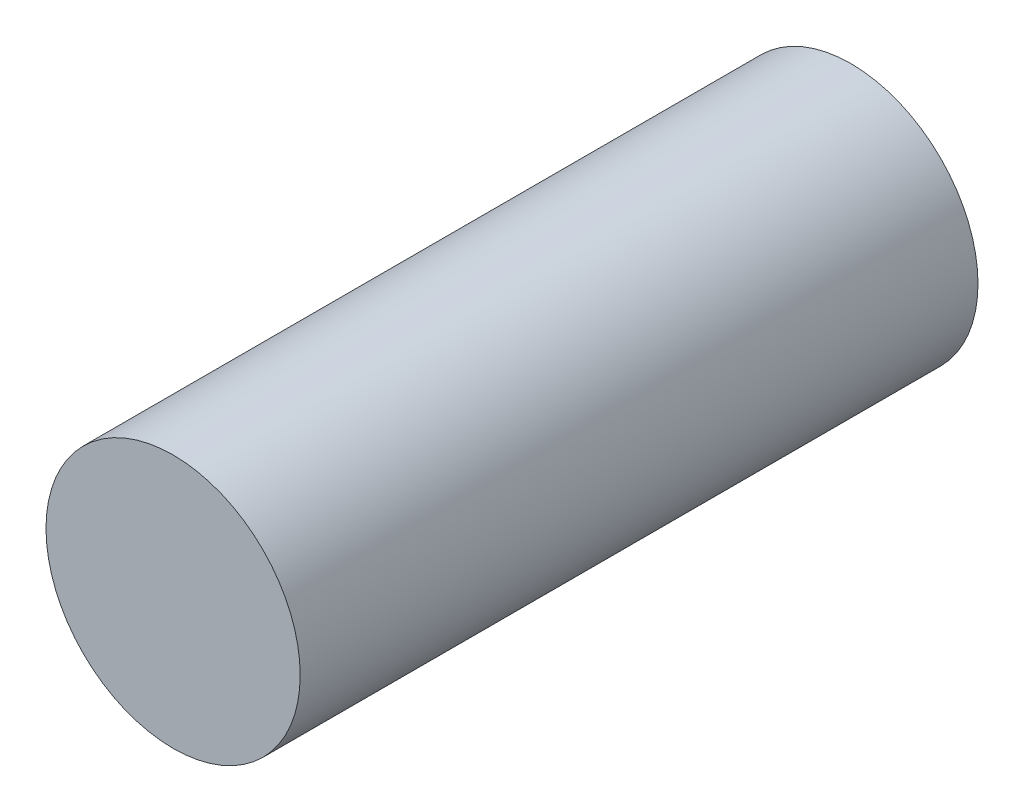
ISO-10303-21;
HEADER;
FILE_DESCRIPTION(('STEP AP214'),'2;1');
FILE_NAME('part.step','',(''),(''),'','','');
FILE_SCHEMA(('AUTOMOTIVE_DESIGN { 1 0 10303 214 1 1 1 1 }'));
ENDSEC;
DATA;
#1=APPLICATION_CONTEXT('core data for automotive mechanical design processes');
#2=APPLICATION_PROTOCOL_DEFINITION('international standard','automotive_design',2000,#1);
#3=PRODUCT_CONTEXT('',#1,'mechanical');
#4=PRODUCT('Part','Part','',(#3));
#5=PRODUCT_RELATED_PRODUCT_CATEGORY('part','',(#4));
#6=PRODUCT_DEFINITION_FORMATION('','',#4);
#7=PRODUCT_DEFINITION_CONTEXT('part definition',#1,'design');
#8=PRODUCT_DEFINITION('design','',#6,#7);
#9=PRODUCT_DEFINITION_SHAPE('','',#8);
#10=(LENGTH_UNIT() NAMED_UNIT(*) SI_UNIT(.MILLI.,.METRE.));
#11=(NAMED_UNIT(*) PLANE_ANGLE_UNIT() SI_UNIT($,.RADIAN.));
#12=(NAMED_UNIT(*) SI_UNIT($,.STERADIAN.) SOLID_ANGLE_UNIT());
#13=UNCERTAINTY_MEASURE_WITH_UNIT(LENGTH_MEASURE(1.E-05),#10,'distance_accuracy_value','');
#14=(GEOMETRIC_REPRESENTATION_CONTEXT(3) GLOBAL_UNCERTAINTY_ASSIGNED_CONTEXT((#13)) GLOBAL_UNIT_ASSIGNED_CONTEXT((#10,
#11,#12)) REPRESENTATION_CONTEXT('',''));
#15=CARTESIAN_POINT('',(0.,0.,0.));
#16=DIRECTION('',(0.,0.,1.));
#17=DIRECTION('',(1.,0.,0.));
#18=AXIS2_PLACEMENT_3D('',#15,#16,#17);
#19=CARTESIAN_POINT('',(-163.126236957769,-95.5245066159686,-10.));
#20=DIRECTION('',(0.,0.,1.));
#21=DIRECTION('',(1.,0.,0.));
#22=AXIS2_PLACEMENT_3D('',#19,#20,#21);
#23=CYLINDRICAL_SURFACE('',#22,3.75000000000001);
#24=CARTESIAN_POINT('',(-163.126236957769,-95.5245066159686,-10.));
#25=DIRECTION('',(0.,0.,1.));
#26=DIRECTION('',(1.,0.,0.));
#27=AXIS2_PLACEMENT_3D('',#24,#25,#26);
#28=CIRCLE('',#27,3.75000000000001);
#29=CARTESIAN_POINT('',(-159.376236957769,-95.5245066159686,-10.));
#30=VERTEX_POINT('',#29);
#31=EDGE_CURVE('E41',#30,#30,#28,.T.);
#32=ORIENTED_EDGE('',*,*,#31,.T.);
#33=EDGE_LOOP('',(#32));
#34=FACE_BOUND('',#33,.T.);
#35=CARTESIAN_POINT('',(-163.126236957769,-95.5245066159686,10.));
#36=DIRECTION('',(0.,0.,1.));
#37=DIRECTION('',(1.,0.,0.));
#38=AXIS2_PLACEMENT_3D('',#35,#36,#37);
#39=CIRCLE('',#38,3.75000000000001);
#40=CARTESIAN_POINT('',(-159.376236957769,-95.5245066159686,10.));
#41=VERTEX_POINT('',#40);
#42=EDGE_CURVE('E10',#41,#41,#39,.T.);
#43=ORIENTED_EDGE('',*,*,#42,.F.);
#44=EDGE_LOOP('',(#43));
#45=FACE_BOUND('',#44,.T.);
#46=ADVANCED_FACE('F34',(#34,#45),#23,.T.);
#47=CARTESIAN_POINT('',(-163.126236957769,-95.5245066159686,-10.));
#48=DIRECTION('',(0.,0.,1.));
#49=DIRECTION('',(1.,0.,0.));
#50=AXIS2_PLACEMENT_3D('',#47,#48,#49);
#51=PLANE('',#50);
#52=ORIENTED_EDGE('',*,*,#31,.F.);
#53=EDGE_LOOP('',(#52));
#54=FACE_BOUND('',#53,.T.);
#55=ADVANCED_FACE('F49',(#54),#51,.F.);
#56=CARTESIAN_POINT('',(-163.126236957769,-95.5245066159686,10.));
#57=DIRECTION('',(0.,0.,1.));
#58=DIRECTION('',(1.,0.,0.));
#59=AXIS2_PLACEMENT_3D('',#56,#57,#58);
#60=PLANE('',#59);
#61=ORIENTED_EDGE('',*,*,#42,.T.);
#62=EDGE_LOOP('',(#61));
#63=FACE_BOUND('',#62,.T.);
#64=ADVANCED_FACE('F36',(#63),#60,.T.);
#65=CLOSED_SHELL('',(#46,#55,#64));
#66=MANIFOLD_SOLID_BREP('B2',#65);
#67=ADVANCED_BREP_SHAPE_REPRESENTATION('',(#18,#66),#14);
#68=SHAPE_DEFINITION_REPRESENTATION(#9,#67);
ENDSEC;
END-ISO-10303-21;
